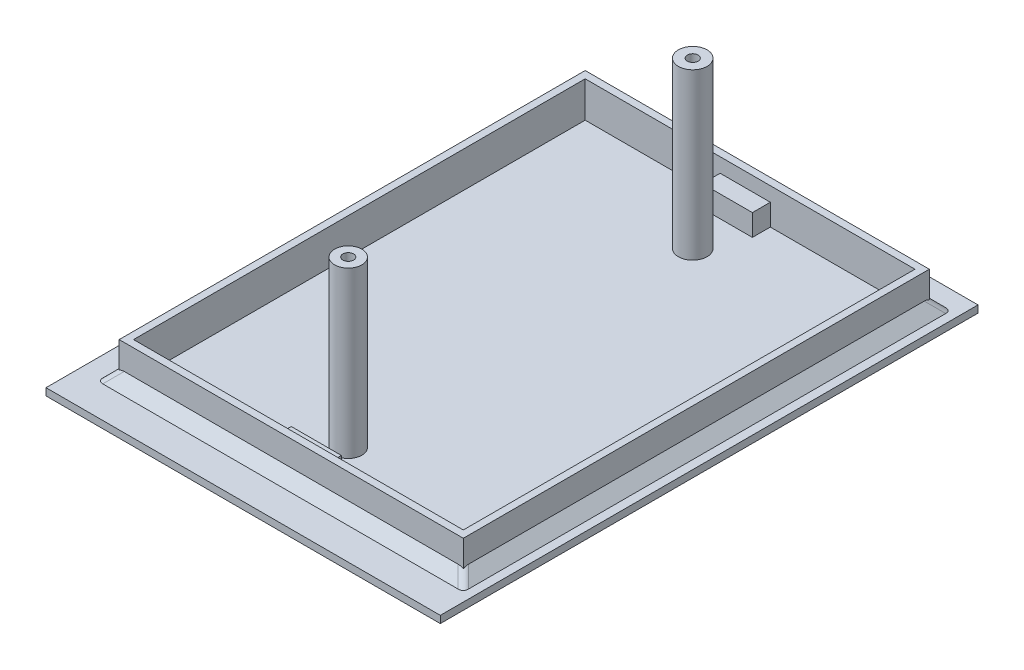
ISO-10303-21;
HEADER;
FILE_DESCRIPTION(('STEP AP214'),'2;1');
FILE_NAME('part.step','',(''),(''),'','','');
FILE_SCHEMA(('AUTOMOTIVE_DESIGN { 1 0 10303 214 1 1 1 1 }'));
ENDSEC;
DATA;
#1=APPLICATION_CONTEXT('core data for automotive mechanical design processes');
#2=APPLICATION_PROTOCOL_DEFINITION('international standard','automotive_design',2000,#1);
#3=PRODUCT_CONTEXT('',#1,'mechanical');
#4=PRODUCT('Part','Part','',(#3));
#5=PRODUCT_RELATED_PRODUCT_CATEGORY('part','',(#4));
#6=PRODUCT_DEFINITION_FORMATION('','',#4);
#7=PRODUCT_DEFINITION_CONTEXT('part definition',#1,'design');
#8=PRODUCT_DEFINITION('design','',#6,#7);
#9=PRODUCT_DEFINITION_SHAPE('','',#8);
#10=(LENGTH_UNIT() NAMED_UNIT(*) SI_UNIT(.MILLI.,.METRE.));
#11=(NAMED_UNIT(*) PLANE_ANGLE_UNIT() SI_UNIT($,.RADIAN.));
#12=(NAMED_UNIT(*) SI_UNIT($,.STERADIAN.) SOLID_ANGLE_UNIT());
#13=UNCERTAINTY_MEASURE_WITH_UNIT(LENGTH_MEASURE(1.E-05),#10,'distance_accuracy_value','');
#14=(GEOMETRIC_REPRESENTATION_CONTEXT(3) GLOBAL_UNCERTAINTY_ASSIGNED_CONTEXT((#13)) GLOBAL_UNIT_ASSIGNED_CONTEXT((#10,
#11,#12)) REPRESENTATION_CONTEXT('',''));
#15=CARTESIAN_POINT('',(0.,0.,0.));
#16=DIRECTION('',(0.,0.,1.));
#17=DIRECTION('',(1.,0.,0.));
#18=AXIS2_PLACEMENT_3D('',#15,#16,#17);
#19=CARTESIAN_POINT('',(0.,0.,0.));
#20=DIRECTION('',(0.,1.,0.));
#21=DIRECTION('',(0.,0.,1.));
#22=AXIS2_PLACEMENT_3D('',#19,#20,#21);
#23=PLANE('',#22);
#24=CARTESIAN_POINT('',(1.42387990874169,0.,-8.40605230060947));
#25=DIRECTION('',(0.,1.,0.));
#26=DIRECTION('',(0.,0.,1.));
#27=AXIS2_PLACEMENT_3D('',#24,#25,#26);
#28=CIRCLE('',#27,2.);
#29=CARTESIAN_POINT('',(1.42387990874169,0.,-6.40605230060947));
#30=VERTEX_POINT('',#29);
#31=EDGE_CURVE('E880',#30,#30,#28,.T.);
#32=ORIENTED_EDGE('',*,*,#31,.F.);
#33=EDGE_LOOP('',(#32));
#34=FACE_BOUND('',#33,.T.);
#35=CARTESIAN_POINT('',(1.42387990874168,0.,39.6439476993905));
#36=DIRECTION('',(0.,1.,0.));
#37=DIRECTION('',(0.,0.,1.));
#38=AXIS2_PLACEMENT_3D('',#35,#36,#37);
#39=CIRCLE('',#38,1.9);
#40=CARTESIAN_POINT('',(1.42387990874168,0.,41.5439476993905));
#41=VERTEX_POINT('',#40);
#42=EDGE_CURVE('E868',#41,#41,#39,.T.);
#43=ORIENTED_EDGE('',*,*,#42,.F.);
#44=EDGE_LOOP('',(#43));
#45=FACE_BOUND('',#44,.T.);
#46=DIRECTION('',(1.,0.,0.));
#47=VECTOR('',#46,1.);
#48=CARTESIAN_POINT('',(-2.75409037972318,0.,-13.9060523006095));
#49=LINE('',#48,#47);
#50=CARTESIAN_POINT('',(-2.75409037972318,0.,-13.9060523006095));
#51=VERTEX_POINT('',#50);
#52=CARTESIAN_POINT('',(4.24590962027682,0.,-13.9060523006095));
#53=VERTEX_POINT('',#52);
#54=EDGE_CURVE('E863',#51,#53,#49,.T.);
#55=ORIENTED_EDGE('',*,*,#54,.F.);
#56=DIRECTION('',(0.,0.,1.));
#57=VECTOR('',#56,1.);
#58=CARTESIAN_POINT('',(-2.75409037972318,0.,-16.4060523006095));
#59=LINE('',#58,#57);
#60=CARTESIAN_POINT('',(-2.75409037972318,0.,-16.4060523006095));
#61=VERTEX_POINT('',#60);
#62=EDGE_CURVE('E245',#61,#51,#59,.T.);
#63=ORIENTED_EDGE('',*,*,#62,.F.);
#64=DIRECTION('',(-1.,0.,0.));
#65=VECTOR('',#64,1.);
#66=CARTESIAN_POINT('',(-21.5761200912583,0.,-16.4060523006095));
#67=LINE('',#66,#65);
#68=CARTESIAN_POINT('',(-21.5761200912583,0.,-16.4060523006095));
#69=VERTEX_POINT('',#68);
#70=EDGE_CURVE('E296',#61,#69,#67,.T.);
#71=ORIENTED_EDGE('',*,*,#70,.T.);
#72=DIRECTION('',(0.,0.,1.));
#73=VECTOR('',#72,1.);
#74=CARTESIAN_POINT('',(-21.5761200912583,0.,-16.4060523006095));
#75=LINE('',#74,#73);
#76=CARTESIAN_POINT('',(-21.5761200912583,0.,46.5939476993905));
#77=VERTEX_POINT('',#76);
#78=EDGE_CURVE('E277',#69,#77,#75,.T.);
#79=ORIENTED_EDGE('',*,*,#78,.T.);
#80=DIRECTION('',(1.,0.,0.));
#81=VECTOR('',#80,1.);
#82=CARTESIAN_POINT('',(-21.5761200912583,0.,46.5939476993905));
#83=LINE('',#82,#81);
#84=CARTESIAN_POINT('',(-2.07612009125831,0.,46.5939476993905));
#85=VERTEX_POINT('',#84);
#86=EDGE_CURVE('E291',#77,#85,#83,.T.);
#87=ORIENTED_EDGE('',*,*,#86,.T.);
#88=DIRECTION('',(0.,0.,1.));
#89=VECTOR('',#88,1.);
#90=CARTESIAN_POINT('',(-2.07612009125831,0.,46.5939476993905));
#91=LINE('',#90,#89);
#92=CARTESIAN_POINT('',(-2.07612009125831,0.,44.0939476993905));
#93=VERTEX_POINT('',#92);
#94=EDGE_CURVE('E259',#93,#85,#91,.T.);
#95=ORIENTED_EDGE('',*,*,#94,.F.);
#96=DIRECTION('',(-1.,0.,0.));
#97=VECTOR('',#96,1.);
#98=CARTESIAN_POINT('',(4.92387990874169,0.,44.0939476993905));
#99=LINE('',#98,#97);
#100=CARTESIAN_POINT('',(4.92387990874169,0.,44.0939476993905));
#101=VERTEX_POINT('',#100);
#102=EDGE_CURVE('E249',#101,#93,#99,.T.);
#103=ORIENTED_EDGE('',*,*,#102,.F.);
#104=DIRECTION('',(0.,0.,-1.));
#105=VECTOR('',#104,1.);
#106=CARTESIAN_POINT('',(4.92387990874169,0.,46.5939476993905));
#107=LINE('',#106,#105);
#108=CARTESIAN_POINT('',(4.92387990874169,0.,46.5939476993905));
#109=VERTEX_POINT('',#108);
#110=EDGE_CURVE('E246',#109,#101,#107,.T.);
#111=ORIENTED_EDGE('',*,*,#110,.F.);
#112=CARTESIAN_POINT('',(24.4238799087417,0.,46.5939476993905));
#113=VERTEX_POINT('',#112);
#114=EDGE_CURVE('E290',#109,#113,#83,.T.);
#115=ORIENTED_EDGE('',*,*,#114,.T.);
#116=DIRECTION('',(0.,0.,-1.));
#117=VECTOR('',#116,1.);
#118=CARTESIAN_POINT('',(24.4238799087417,0.,-16.4060523006095));
#119=LINE('',#118,#117);
#120=CARTESIAN_POINT('',(24.4238799087417,0.,-16.4060523006095));
#121=VERTEX_POINT('',#120);
#122=EDGE_CURVE('E294',#113,#121,#119,.T.);
#123=ORIENTED_EDGE('',*,*,#122,.T.);
#124=CARTESIAN_POINT('',(4.24590962027681,0.,-16.4060523006095));
#125=VERTEX_POINT('',#124);
#126=EDGE_CURVE('E281',#121,#125,#67,.T.);
#127=ORIENTED_EDGE('',*,*,#126,.T.);
#128=DIRECTION('',(0.,0.,-1.));
#129=VECTOR('',#128,1.);
#130=CARTESIAN_POINT('',(4.24590962027682,0.,-16.4060523006095));
#131=LINE('',#130,#129);
#132=EDGE_CURVE('E242',#53,#125,#131,.T.);
#133=ORIENTED_EDGE('',*,*,#132,.F.);
#134=EDGE_LOOP('',(#55,#63,#71,#79,#87,#95,#103,#111,#115,#123,#127,#133));
#135=FACE_BOUND('',#134,.T.);
#136=ADVANCED_FACE('F36',(#34,#45,#135),#23,.T.);
#137=CARTESIAN_POINT('',(-21.5761200912583,5.,-16.4060523006095));
#138=DIRECTION('',(0.,0.,1.));
#139=DIRECTION('',(1.,0.,0.));
#140=AXIS2_PLACEMENT_3D('',#137,#138,#139);
#141=PLANE('',#140);
#142=ORIENTED_EDGE('',*,*,#70,.F.);
#143=DIRECTION('',(0.,-1.,0.));
#144=VECTOR('',#143,1.);
#145=CARTESIAN_POINT('',(-2.75409037972318,3.,-16.4060523006095));
#146=LINE('',#145,#144);
#147=CARTESIAN_POINT('',(-2.75409037972318,3.,-16.4060523006095));
#148=VERTEX_POINT('',#147);
#149=EDGE_CURVE('E858',#148,#61,#146,.T.);
#150=ORIENTED_EDGE('',*,*,#149,.F.);
#151=DIRECTION('',(-1.,0.,0.));
#152=VECTOR('',#151,1.);
#153=CARTESIAN_POINT('',(-2.75409037972318,3.,-16.4060523006095));
#154=LINE('',#153,#152);
#155=CARTESIAN_POINT('',(4.24590962027681,3.,-16.4060523006095));
#156=VERTEX_POINT('',#155);
#157=EDGE_CURVE('E239',#156,#148,#154,.T.);
#158=ORIENTED_EDGE('',*,*,#157,.F.);
#159=DIRECTION('',(0.,-1.,0.));
#160=VECTOR('',#159,1.);
#161=CARTESIAN_POINT('',(4.24590962027682,3.,-16.4060523006095));
#162=LINE('',#161,#160);
#163=EDGE_CURVE('E251',#156,#125,#162,.T.);
#164=ORIENTED_EDGE('',*,*,#163,.T.);
#165=ORIENTED_EDGE('',*,*,#126,.F.);
#166=DIRECTION('',(0.,-1.,0.));
#167=VECTOR('',#166,1.);
#168=CARTESIAN_POINT('',(24.4238799087417,5.,-16.4060523006095));
#169=LINE('',#168,#167);
#170=CARTESIAN_POINT('',(24.4238799087417,5.,-16.4060523006095));
#171=VERTEX_POINT('',#170);
#172=EDGE_CURVE('E301',#171,#121,#169,.T.);
#173=ORIENTED_EDGE('',*,*,#172,.F.);
#174=DIRECTION('',(-1.,0.,0.));
#175=VECTOR('',#174,1.);
#176=CARTESIAN_POINT('',(-21.5761200912583,5.,-16.4060523006095));
#177=LINE('',#176,#175);
#178=CARTESIAN_POINT('',(-21.5761200912583,5.,-16.4060523006095));
#179=VERTEX_POINT('',#178);
#180=EDGE_CURVE('E286',#171,#179,#177,.T.);
#181=ORIENTED_EDGE('',*,*,#180,.T.);
#182=DIRECTION('',(0.,-1.,0.));
#183=VECTOR('',#182,1.);
#184=CARTESIAN_POINT('',(-21.5761200912583,5.,-16.4060523006095));
#185=LINE('',#184,#183);
#186=EDGE_CURVE('E288',#179,#69,#185,.T.);
#187=ORIENTED_EDGE('',*,*,#186,.T.);
#188=EDGE_LOOP('',(#142,#150,#158,#164,#165,#173,#181,#187));
#189=FACE_BOUND('',#188,.T.);
#190=ADVANCED_FACE('F490',(#189),#141,.T.);
#191=CARTESIAN_POINT('',(-21.5761200912583,5.,46.5939476993905));
#192=DIRECTION('',(0.,0.,-1.));
#193=DIRECTION('',(-1.,0.,0.));
#194=AXIS2_PLACEMENT_3D('',#191,#192,#193);
#195=PLANE('',#194);
#196=ORIENTED_EDGE('',*,*,#114,.F.);
#197=DIRECTION('',(0.,-1.,0.));
#198=VECTOR('',#197,1.);
#199=CARTESIAN_POINT('',(4.92387990874169,3.,46.5939476993905));
#200=LINE('',#199,#198);
#201=CARTESIAN_POINT('',(4.92387990874169,3.,46.5939476993905));
#202=VERTEX_POINT('',#201);
#203=EDGE_CURVE('E264',#202,#109,#200,.T.);
#204=ORIENTED_EDGE('',*,*,#203,.F.);
#205=DIRECTION('',(1.,0.,0.));
#206=VECTOR('',#205,1.);
#207=CARTESIAN_POINT('',(4.92387990874169,3.,46.5939476993905));
#208=LINE('',#207,#206);
#209=CARTESIAN_POINT('',(-2.07612009125831,3.,46.5939476993905));
#210=VERTEX_POINT('',#209);
#211=EDGE_CURVE('E263',#210,#202,#208,.T.);
#212=ORIENTED_EDGE('',*,*,#211,.F.);
#213=DIRECTION('',(0.,-1.,0.));
#214=VECTOR('',#213,1.);
#215=CARTESIAN_POINT('',(-2.07612009125831,3.,46.5939476993905));
#216=LINE('',#215,#214);
#217=EDGE_CURVE('E270',#210,#85,#216,.T.);
#218=ORIENTED_EDGE('',*,*,#217,.T.);
#219=ORIENTED_EDGE('',*,*,#86,.F.);
#220=DIRECTION('',(0.,-1.,0.));
#221=VECTOR('',#220,1.);
#222=CARTESIAN_POINT('',(-21.5761200912583,5.,46.5939476993905));
#223=LINE('',#222,#221);
#224=CARTESIAN_POINT('',(-21.5761200912583,5.,46.5939476993905));
#225=VERTEX_POINT('',#224);
#226=EDGE_CURVE('E307',#225,#77,#223,.T.);
#227=ORIENTED_EDGE('',*,*,#226,.F.);
#228=DIRECTION('',(1.,0.,0.));
#229=VECTOR('',#228,1.);
#230=CARTESIAN_POINT('',(-21.5761200912583,5.,46.5939476993905));
#231=LINE('',#230,#229);
#232=CARTESIAN_POINT('',(24.4238799087417,5.,46.5939476993905));
#233=VERTEX_POINT('',#232);
#234=EDGE_CURVE('E280',#225,#233,#231,.T.);
#235=ORIENTED_EDGE('',*,*,#234,.T.);
#236=DIRECTION('',(0.,-1.,0.));
#237=VECTOR('',#236,1.);
#238=CARTESIAN_POINT('',(24.4238799087417,5.,46.5939476993905));
#239=LINE('',#238,#237);
#240=EDGE_CURVE('E304',#233,#113,#239,.T.);
#241=ORIENTED_EDGE('',*,*,#240,.T.);
#242=EDGE_LOOP('',(#196,#204,#212,#218,#219,#227,#235,#241));
#243=FACE_BOUND('',#242,.T.);
#244=ADVANCED_FACE('F498',(#243),#195,.T.);
#245=DIRECTION('',(1.,0.,0.));
#246=VECTOR('',#245,1.);
#247=CARTESIAN_POINT('',(0.,0.,-18.9060523006095));
#248=LINE('',#247,#246);
#249=CARTESIAN_POINT('',(-23.3690133100718,0.,-18.9060523006095));
#250=VERTEX_POINT('',#249);
#251=CARTESIAN_POINT('',(26.2167731275551,0.,-18.9060523006095));
#252=VERTEX_POINT('',#251);
#253=EDGE_CURVE('E363',#250,#252,#248,.T.);
#254=ORIENTED_EDGE('',*,*,#253,.T.);
#255=CARTESIAN_POINT('',(25.5096663463686,0.,-17.4918387382364));
#256=DIRECTION('',(0.,1.,0.));
#257=DIRECTION('',(-0.707106781186548,0.,0.707106781186547));
#258=AXIS2_PLACEMENT_3D('',#255,#256,#257);
#259=ELLIPSE('',#258,1.73205080756888,1.);
#260=CARTESIAN_POINT('',(26.9238799087417,0.,-18.1989455194229));
#261=VERTEX_POINT('',#260);
#262=EDGE_CURVE('E413',#252,#261,#259,.F.);
#263=ORIENTED_EDGE('',*,*,#262,.T.);
#264=DIRECTION('',(0.,0.,1.));
#265=VECTOR('',#264,1.);
#266=CARTESIAN_POINT('',(26.9238799087417,0.,0.));
#267=LINE('',#266,#265);
#268=CARTESIAN_POINT('',(26.9238799087417,0.,48.386840918204));
#269=VERTEX_POINT('',#268);
#270=EDGE_CURVE('E366',#261,#269,#267,.T.);
#271=ORIENTED_EDGE('',*,*,#270,.T.);
#272=CARTESIAN_POINT('',(25.5096663463686,0.,47.6797341370174));
#273=DIRECTION('',(0.,1.,0.));
#274=DIRECTION('',(-0.707106781186548,0.,-0.707106781186547));
#275=AXIS2_PLACEMENT_3D('',#272,#273,#274);
#276=ELLIPSE('',#275,1.73205080756888,1.);
#277=CARTESIAN_POINT('',(26.2167731275551,0.,49.0939476993905));
#278=VERTEX_POINT('',#277);
#279=EDGE_CURVE('E419',#269,#278,#276,.F.);
#280=ORIENTED_EDGE('',*,*,#279,.T.);
#281=DIRECTION('',(-1.,0.,0.));
#282=VECTOR('',#281,1.);
#283=CARTESIAN_POINT('',(0.,0.,49.0939476993905));
#284=LINE('',#283,#282);
#285=CARTESIAN_POINT('',(-23.3690133100718,0.,49.0939476993905));
#286=VERTEX_POINT('',#285);
#287=EDGE_CURVE('E369',#278,#286,#284,.T.);
#288=ORIENTED_EDGE('',*,*,#287,.T.);
#289=CARTESIAN_POINT('',(-22.6619065288852,0.,47.6797341370174));
#290=DIRECTION('',(0.,1.,0.));
#291=DIRECTION('',(-0.707106781186547,0.,0.707106781186548));
#292=AXIS2_PLACEMENT_3D('',#289,#290,#291);
#293=ELLIPSE('',#292,1.73205080756888,1.);
#294=CARTESIAN_POINT('',(-24.0761200912583,0.,48.386840918204));
#295=VERTEX_POINT('',#294);
#296=EDGE_CURVE('E421',#286,#295,#293,.F.);
#297=ORIENTED_EDGE('',*,*,#296,.T.);
#298=DIRECTION('',(0.,0.,-1.));
#299=VECTOR('',#298,1.);
#300=CARTESIAN_POINT('',(-24.0761200912583,0.,0.));
#301=LINE('',#300,#299);
#302=CARTESIAN_POINT('',(-24.0761200912583,0.,-18.1989455194229));
#303=VERTEX_POINT('',#302);
#304=EDGE_CURVE('E360',#295,#303,#301,.T.);
#305=ORIENTED_EDGE('',*,*,#304,.T.);
#306=CARTESIAN_POINT('',(-22.6619065288852,0.,-17.4918387382364));
#307=DIRECTION('',(0.,1.,0.));
#308=DIRECTION('',(-0.707106781186547,0.,-0.707106781186548));
#309=AXIS2_PLACEMENT_3D('',#306,#307,#308);
#310=ELLIPSE('',#309,1.73205080756888,1.);
#311=EDGE_CURVE('E401',#303,#250,#310,.F.);
#312=ORIENTED_EDGE('',*,*,#311,.T.);
#313=EDGE_LOOP('',(#254,#263,#271,#280,#288,#297,#305,#312));
#314=FACE_BOUND('',#313,.T.);
#315=DIRECTION('',(0.,0.,1.));
#316=VECTOR('',#315,1.);
#317=CARTESIAN_POINT('',(-26.8692810457516,0.,-21.4901960784314));
#318=LINE('',#317,#316);
#319=CARTESIAN_POINT('',(-26.8692810457516,0.,-21.4901960784314));
#320=VERTEX_POINT('',#319);
#321=CARTESIAN_POINT('',(-26.8692810457516,0.,53.5098039215686));
#322=VERTEX_POINT('',#321);
#323=EDGE_CURVE('E325',#320,#322,#318,.T.);
#324=ORIENTED_EDGE('',*,*,#323,.T.);
#325=DIRECTION('',(1.,0.,0.));
#326=VECTOR('',#325,1.);
#327=CARTESIAN_POINT('',(-26.8692810457516,0.,53.5098039215686));
#328=LINE('',#327,#326);
#329=CARTESIAN_POINT('',(28.1307189542484,0.,53.5098039215686));
#330=VERTEX_POINT('',#329);
#331=EDGE_CURVE('E342',#322,#330,#328,.T.);
#332=ORIENTED_EDGE('',*,*,#331,.T.);
#333=DIRECTION('',(0.,0.,-1.));
#334=VECTOR('',#333,1.);
#335=CARTESIAN_POINT('',(28.1307189542484,0.,-21.4901960784314));
#336=LINE('',#335,#334);
#337=CARTESIAN_POINT('',(28.1307189542484,0.,-21.4901960784314));
#338=VERTEX_POINT('',#337);
#339=EDGE_CURVE('E345',#330,#338,#336,.T.);
#340=ORIENTED_EDGE('',*,*,#339,.T.);
#341=DIRECTION('',(-1.,0.,0.));
#342=VECTOR('',#341,1.);
#343=CARTESIAN_POINT('',(-26.8692810457516,0.,-21.4901960784314));
#344=LINE('',#343,#342);
#345=EDGE_CURVE('E330',#338,#320,#344,.T.);
#346=ORIENTED_EDGE('',*,*,#345,.T.);
#347=EDGE_LOOP('',(#324,#332,#340,#346));
#348=FACE_BOUND('',#347,.T.);
#349=ADVANCED_FACE('F462',(#314,#348),#23,.T.);
#350=CARTESIAN_POINT('',(-26.8692810457516,-1.,-21.4901960784314));
#351=DIRECTION('',(-1.,0.,0.));
#352=DIRECTION('',(0.,0.,1.));
#353=AXIS2_PLACEMENT_3D('',#350,#351,#352);
#354=PLANE('',#353);
#355=ORIENTED_EDGE('',*,*,#323,.F.);
#356=DIRECTION('',(0.,1.,0.));
#357=VECTOR('',#356,1.);
#358=CARTESIAN_POINT('',(-26.8692810457516,-1.,-21.4901960784314));
#359=LINE('',#358,#357);
#360=CARTESIAN_POINT('',(-26.8692810457516,-1.,-21.4901960784314));
#361=VERTEX_POINT('',#360);
#362=EDGE_CURVE('E350',#361,#320,#359,.T.);
#363=ORIENTED_EDGE('',*,*,#362,.F.);
#364=DIRECTION('',(0.,0.,1.));
#365=VECTOR('',#364,1.);
#366=CARTESIAN_POINT('',(-26.8692810457516,-1.,-21.4901960784314));
#367=LINE('',#366,#365);
#368=CARTESIAN_POINT('',(-26.8692810457516,-1.,53.5098039215686));
#369=VERTEX_POINT('',#368);
#370=EDGE_CURVE('E326',#361,#369,#367,.T.);
#371=ORIENTED_EDGE('',*,*,#370,.T.);
#372=DIRECTION('',(0.,1.,0.));
#373=VECTOR('',#372,1.);
#374=CARTESIAN_POINT('',(-26.8692810457516,-1.,53.5098039215686));
#375=LINE('',#374,#373);
#376=EDGE_CURVE('E339',#369,#322,#375,.T.);
#377=ORIENTED_EDGE('',*,*,#376,.T.);
#378=EDGE_LOOP('',(#355,#363,#371,#377));
#379=FACE_BOUND('',#378,.T.);
#380=ADVANCED_FACE('F506',(#379),#354,.T.);
#381=CARTESIAN_POINT('',(-26.8692810457516,-1.,-21.4901960784314));
#382=DIRECTION('',(0.,0.,-1.));
#383=DIRECTION('',(-1.,0.,0.));
#384=AXIS2_PLACEMENT_3D('',#381,#382,#383);
#385=PLANE('',#384);
#386=ORIENTED_EDGE('',*,*,#345,.F.);
#387=DIRECTION('',(0.,1.,0.));
#388=VECTOR('',#387,1.);
#389=CARTESIAN_POINT('',(28.1307189542484,-1.,-21.4901960784314));
#390=LINE('',#389,#388);
#391=CARTESIAN_POINT('',(28.1307189542484,-1.,-21.4901960784314));
#392=VERTEX_POINT('',#391);
#393=EDGE_CURVE('E353',#392,#338,#390,.T.);
#394=ORIENTED_EDGE('',*,*,#393,.F.);
#395=DIRECTION('',(-1.,0.,0.));
#396=VECTOR('',#395,1.);
#397=CARTESIAN_POINT('',(-26.8692810457516,-1.,-21.4901960784314));
#398=LINE('',#397,#396);
#399=EDGE_CURVE('E336',#392,#361,#398,.T.);
#400=ORIENTED_EDGE('',*,*,#399,.T.);
#401=ORIENTED_EDGE('',*,*,#362,.T.);
#402=EDGE_LOOP('',(#386,#394,#400,#401));
#403=FACE_BOUND('',#402,.T.);
#404=ADVANCED_FACE('F512',(#403),#385,.T.);
#405=CARTESIAN_POINT('',(28.1307189542484,-1.,-21.4901960784314));
#406=DIRECTION('',(1.,0.,0.));
#407=DIRECTION('',(0.,0.,-1.));
#408=AXIS2_PLACEMENT_3D('',#405,#406,#407);
#409=PLANE('',#408);
#410=ORIENTED_EDGE('',*,*,#339,.F.);
#411=DIRECTION('',(0.,1.,0.));
#412=VECTOR('',#411,1.);
#413=CARTESIAN_POINT('',(28.1307189542484,-1.,53.5098039215686));
#414=LINE('',#413,#412);
#415=CARTESIAN_POINT('',(28.1307189542484,-1.,53.5098039215686));
#416=VERTEX_POINT('',#415);
#417=EDGE_CURVE('E355',#416,#330,#414,.T.);
#418=ORIENTED_EDGE('',*,*,#417,.F.);
#419=DIRECTION('',(0.,0.,-1.));
#420=VECTOR('',#419,1.);
#421=CARTESIAN_POINT('',(28.1307189542484,-1.,-21.4901960784314));
#422=LINE('',#421,#420);
#423=EDGE_CURVE('E333',#416,#392,#422,.T.);
#424=ORIENTED_EDGE('',*,*,#423,.T.);
#425=ORIENTED_EDGE('',*,*,#393,.T.);
#426=EDGE_LOOP('',(#410,#418,#424,#425));
#427=FACE_BOUND('',#426,.T.);
#428=ADVANCED_FACE('F544',(#427),#409,.T.);
#429=CARTESIAN_POINT('',(-26.8692810457516,-1.,53.5098039215686));
#430=DIRECTION('',(0.,0.,1.));
#431=DIRECTION('',(1.,0.,0.));
#432=AXIS2_PLACEMENT_3D('',#429,#430,#431);
#433=PLANE('',#432);
#434=ORIENTED_EDGE('',*,*,#331,.F.);
#435=ORIENTED_EDGE('',*,*,#376,.F.);
#436=DIRECTION('',(1.,0.,0.));
#437=VECTOR('',#436,1.);
#438=CARTESIAN_POINT('',(-26.8692810457516,-1.,53.5098039215686));
#439=LINE('',#438,#437);
#440=EDGE_CURVE('E329',#369,#416,#439,.T.);
#441=ORIENTED_EDGE('',*,*,#440,.T.);
#442=ORIENTED_EDGE('',*,*,#417,.T.);
#443=EDGE_LOOP('',(#434,#435,#441,#442));
#444=FACE_BOUND('',#443,.T.);
#445=ADVANCED_FACE('F539',(#444),#433,.T.);
#446=CARTESIAN_POINT('',(0.,-1.,0.));
#447=DIRECTION('',(0.,1.,0.));
#448=DIRECTION('',(0.,0.,1.));
#449=AXIS2_PLACEMENT_3D('',#446,#447,#448);
#450=PLANE('',#449);
#451=ORIENTED_EDGE('',*,*,#370,.F.);
#452=ORIENTED_EDGE('',*,*,#399,.F.);
#453=ORIENTED_EDGE('',*,*,#423,.F.);
#454=ORIENTED_EDGE('',*,*,#440,.F.);
#455=EDGE_LOOP('',(#451,#452,#453,#454));
#456=FACE_BOUND('',#455,.T.);
#457=ADVANCED_FACE('F531',(#456),#450,.F.);
#458=CARTESIAN_POINT('',(0.,5.,0.));
#459=DIRECTION('',(0.,1.,0.));
#460=DIRECTION('',(0.,0.,1.));
#461=AXIS2_PLACEMENT_3D('',#458,#459,#460);
#462=PLANE('',#461);
#463=DIRECTION('',(0.,0.,1.));
#464=VECTOR('',#463,1.);
#465=CARTESIAN_POINT('',(-22.5761200912583,5.,-17.4060523006095));
#466=LINE('',#465,#464);
#467=CARTESIAN_POINT('',(-22.5761200912583,5.,-17.4060523006095));
#468=VERTEX_POINT('',#467);
#469=CARTESIAN_POINT('',(-22.5761200912583,5.,47.5939476993905));
#470=VERTEX_POINT('',#469);
#471=EDGE_CURVE('E310',#468,#470,#466,.T.);
#472=ORIENTED_EDGE('',*,*,#471,.T.);
#473=DIRECTION('',(1.,0.,0.));
#474=VECTOR('',#473,1.);
#475=CARTESIAN_POINT('',(-22.5761200912583,5.,47.5939476993905));
#476=LINE('',#475,#474);
#477=CARTESIAN_POINT('',(25.4238799087417,5.,47.5939476993905));
#478=VERTEX_POINT('',#477);
#479=EDGE_CURVE('E313',#470,#478,#476,.T.);
#480=ORIENTED_EDGE('',*,*,#479,.T.);
#481=DIRECTION('',(0.,0.,-1.));
#482=VECTOR('',#481,1.);
#483=CARTESIAN_POINT('',(25.4238799087417,5.,-17.4060523006095));
#484=LINE('',#483,#482);
#485=CARTESIAN_POINT('',(25.4238799087417,5.,-17.4060523006095));
#486=VERTEX_POINT('',#485);
#487=EDGE_CURVE('E315',#478,#486,#484,.T.);
#488=ORIENTED_EDGE('',*,*,#487,.T.);
#489=DIRECTION('',(-1.,0.,0.));
#490=VECTOR('',#489,1.);
#491=CARTESIAN_POINT('',(-22.5761200912583,5.,-17.4060523006095));
#492=LINE('',#491,#490);
#493=EDGE_CURVE('E317',#486,#468,#492,.T.);
#494=ORIENTED_EDGE('',*,*,#493,.T.);
#495=EDGE_LOOP('',(#472,#480,#488,#494));
#496=FACE_BOUND('',#495,.T.);
#497=ORIENTED_EDGE('',*,*,#234,.F.);
#498=DIRECTION('',(0.,0.,1.));
#499=VECTOR('',#498,1.);
#500=CARTESIAN_POINT('',(-21.5761200912583,5.,-16.4060523006095));
#501=LINE('',#500,#499);
#502=EDGE_CURVE('E278',#179,#225,#501,.T.);
#503=ORIENTED_EDGE('',*,*,#502,.F.);
#504=ORIENTED_EDGE('',*,*,#180,.F.);
#505=DIRECTION('',(0.,0.,-1.));
#506=VECTOR('',#505,1.);
#507=CARTESIAN_POINT('',(24.4238799087417,5.,-16.4060523006095));
#508=LINE('',#507,#506);
#509=EDGE_CURVE('E283',#233,#171,#508,.T.);
#510=ORIENTED_EDGE('',*,*,#509,.F.);
#511=EDGE_LOOP('',(#497,#503,#504,#510));
#512=FACE_BOUND('',#511,.T.);
#513=ADVANCED_FACE('F446',(#496,#512),#462,.T.);
#514=CARTESIAN_POINT('',(-22.5761200912583,5.,-17.4060523006095));
#515=DIRECTION('',(1.,0.,0.));
#516=DIRECTION('',(0.,0.,-1.));
#517=AXIS2_PLACEMENT_3D('',#514,#515,#516);
#518=PLANE('',#517);
#519=DIRECTION('',(0.,-1.,0.));
#520=VECTOR('',#519,1.);
#521=CARTESIAN_POINT('',(-22.5761200912583,5.,-17.4060523006095));
#522=LINE('',#521,#520);
#523=CARTESIAN_POINT('',(-22.5761200912583,1.31053130901849,-17.4060523006095));
#524=VERTEX_POINT('',#523);
#525=EDGE_CURVE('E319',#468,#524,#522,.T.);
#526=ORIENTED_EDGE('',*,*,#525,.T.);
#527=CARTESIAN_POINT('',(-22.5761200912583,0.0857864376269039,-17.4060523006095));
#528=DIRECTION('',(1.,0.,0.));
#529=DIRECTION('',(0.,-0.707106781186548,-0.707106781186548));
#530=AXIS2_PLACEMENT_3D('',#527,#528,#529);
#531=ELLIPSE('',#530,1.73205080756888,1.);
#532=CARTESIAN_POINT('',(-22.5761200912583,1.5,-16.6989455194229));
#533=VERTEX_POINT('',#532);
#534=EDGE_CURVE('E406',#524,#533,#531,.T.);
#535=ORIENTED_EDGE('',*,*,#534,.T.);
#536=DIRECTION('',(0.,0.,1.));
#537=VECTOR('',#536,1.);
#538=CARTESIAN_POINT('',(-22.5761200912583,1.5,-17.4060523006095));
#539=LINE('',#538,#537);
#540=CARTESIAN_POINT('',(-22.5761200912583,1.5,46.886840918204));
#541=VERTEX_POINT('',#540);
#542=EDGE_CURVE('E378',#533,#541,#539,.T.);
#543=ORIENTED_EDGE('',*,*,#542,.T.);
#544=CARTESIAN_POINT('',(-22.5761200912583,0.085786437626904,47.5939476993905));
#545=DIRECTION('',(1.,0.,0.));
#546=DIRECTION('',(0.,-0.707106781186548,0.707106781186548));
#547=AXIS2_PLACEMENT_3D('',#544,#545,#546);
#548=ELLIPSE('',#547,1.73205080756888,1.);
#549=CARTESIAN_POINT('',(-22.5761200912583,1.31053130901849,47.5939476993905));
#550=VERTEX_POINT('',#549);
#551=EDGE_CURVE('E44',#541,#550,#548,.T.);
#552=ORIENTED_EDGE('',*,*,#551,.T.);
#553=DIRECTION('',(0.,-1.,0.));
#554=VECTOR('',#553,1.);
#555=CARTESIAN_POINT('',(-22.5761200912583,5.,47.5939476993905));
#556=LINE('',#555,#554);
#557=EDGE_CURVE('E50',#470,#550,#556,.T.);
#558=ORIENTED_EDGE('',*,*,#557,.F.);
#559=ORIENTED_EDGE('',*,*,#471,.F.);
#560=EDGE_LOOP('',(#526,#535,#543,#552,#558,#559));
#561=FACE_BOUND('',#560,.T.);
#562=ADVANCED_FACE('F425',(#561),#518,.F.);
#563=CARTESIAN_POINT('',(-22.5761200912583,5.,47.5939476993905));
#564=DIRECTION('',(0.,0.,-1.));
#565=DIRECTION('',(-1.,0.,0.));
#566=AXIS2_PLACEMENT_3D('',#563,#564,#565);
#567=PLANE('',#566);
#568=ORIENTED_EDGE('',*,*,#557,.T.);
#569=CARTESIAN_POINT('',(-22.5761200912583,0.0857864376269077,47.5939476993905));
#570=DIRECTION('',(0.,0.,-1.));
#571=DIRECTION('',(-0.707106781186547,-0.707106781186548,0.));
#572=AXIS2_PLACEMENT_3D('',#569,#570,#571);
#573=ELLIPSE('',#572,1.73205080756888,1.);
#574=CARTESIAN_POINT('',(-21.8690133100718,1.5,47.5939476993905));
#575=VERTEX_POINT('',#574);
#576=EDGE_CURVE('E11',#550,#575,#573,.T.);
#577=ORIENTED_EDGE('',*,*,#576,.T.);
#578=DIRECTION('',(1.,0.,0.));
#579=VECTOR('',#578,1.);
#580=CARTESIAN_POINT('',(-22.5761200912583,1.5,47.5939476993905));
#581=LINE('',#580,#579);
#582=CARTESIAN_POINT('',(24.7167731275551,1.5,47.5939476993905));
#583=VERTEX_POINT('',#582);
#584=EDGE_CURVE('E352',#575,#583,#581,.T.);
#585=ORIENTED_EDGE('',*,*,#584,.T.);
#586=CARTESIAN_POINT('',(25.4238799087417,0.0857864376269113,47.5939476993905));
#587=DIRECTION('',(0.,0.,-1.));
#588=DIRECTION('',(-0.707106781186548,0.707106781186547,0.));
#589=AXIS2_PLACEMENT_3D('',#586,#587,#588);
#590=ELLIPSE('',#589,1.73205080756888,1.);
#591=CARTESIAN_POINT('',(25.4238799087417,1.31053130901849,47.5939476993905));
#592=VERTEX_POINT('',#591);
#593=EDGE_CURVE('E415',#583,#592,#590,.T.);
#594=ORIENTED_EDGE('',*,*,#593,.T.);
#595=DIRECTION('',(0.,-1.,0.));
#596=VECTOR('',#595,1.);
#597=CARTESIAN_POINT('',(25.4238799087417,5.,47.5939476993905));
#598=LINE('',#597,#596);
#599=EDGE_CURVE('E58',#478,#592,#598,.T.);
#600=ORIENTED_EDGE('',*,*,#599,.F.);
#601=ORIENTED_EDGE('',*,*,#479,.F.);
#602=EDGE_LOOP('',(#568,#577,#585,#594,#600,#601));
#603=FACE_BOUND('',#602,.T.);
#604=ADVANCED_FACE('F432',(#603),#567,.F.);
#605=CARTESIAN_POINT('',(25.4238799087417,5.,-17.4060523006095));
#606=DIRECTION('',(-1.,0.,0.));
#607=DIRECTION('',(0.,0.,1.));
#608=AXIS2_PLACEMENT_3D('',#605,#606,#607);
#609=PLANE('',#608);
#610=ORIENTED_EDGE('',*,*,#599,.T.);
#611=CARTESIAN_POINT('',(25.4238799087417,0.0857864376268905,47.5939476993906));
#612=DIRECTION('',(-1.,0.,0.));
#613=DIRECTION('',(0.,0.707106781186547,-0.707106781186548));
#614=AXIS2_PLACEMENT_3D('',#611,#612,#613);
#615=ELLIPSE('',#614,1.73205080756888,1.);
#616=CARTESIAN_POINT('',(25.4238799087417,1.5,46.886840918204));
#617=VERTEX_POINT('',#616);
#618=EDGE_CURVE('E417',#592,#617,#615,.T.);
#619=ORIENTED_EDGE('',*,*,#618,.T.);
#620=DIRECTION('',(0.,0.,-1.));
#621=VECTOR('',#620,1.);
#622=CARTESIAN_POINT('',(25.4238799087417,1.5,-17.4060523006095));
#623=LINE('',#622,#621);
#624=CARTESIAN_POINT('',(25.4238799087417,1.5,-16.6989455194229));
#625=VERTEX_POINT('',#624);
#626=EDGE_CURVE('E372',#617,#625,#623,.T.);
#627=ORIENTED_EDGE('',*,*,#626,.T.);
#628=CARTESIAN_POINT('',(25.4238799087417,0.0857864376269047,-17.4060523006095));
#629=DIRECTION('',(-1.,0.,0.));
#630=DIRECTION('',(0.,0.707106781186548,0.707106781186548));
#631=AXIS2_PLACEMENT_3D('',#628,#629,#630);
#632=ELLIPSE('',#631,1.73205080756888,1.);
#633=CARTESIAN_POINT('',(25.4238799087417,1.31053130901849,-17.4060523006095));
#634=VERTEX_POINT('',#633);
#635=EDGE_CURVE('E408',#625,#634,#632,.T.);
#636=ORIENTED_EDGE('',*,*,#635,.T.);
#637=DIRECTION('',(0.,-1.,0.));
#638=VECTOR('',#637,1.);
#639=CARTESIAN_POINT('',(25.4238799087417,5.,-17.4060523006095));
#640=LINE('',#639,#638);
#641=EDGE_CURVE('E321',#486,#634,#640,.T.);
#642=ORIENTED_EDGE('',*,*,#641,.F.);
#643=ORIENTED_EDGE('',*,*,#487,.F.);
#644=EDGE_LOOP('',(#610,#619,#627,#636,#642,#643));
#645=FACE_BOUND('',#644,.T.);
#646=ADVANCED_FACE('F443',(#645),#609,.F.);
#647=CARTESIAN_POINT('',(-22.5761200912583,5.,-17.4060523006095));
#648=DIRECTION('',(0.,0.,1.));
#649=DIRECTION('',(1.,0.,0.));
#650=AXIS2_PLACEMENT_3D('',#647,#648,#649);
#651=PLANE('',#650);
#652=ORIENTED_EDGE('',*,*,#641,.T.);
#653=CARTESIAN_POINT('',(25.4238799087417,0.0857864376269039,-17.4060523006095));
#654=DIRECTION('',(0.,0.,1.));
#655=DIRECTION('',(-0.707106781186548,0.707106781186547,0.));
#656=AXIS2_PLACEMENT_3D('',#653,#654,#655);
#657=ELLIPSE('',#656,1.73205080756888,1.);
#658=CARTESIAN_POINT('',(24.7167731275551,1.5,-17.4060523006095));
#659=VERTEX_POINT('',#658);
#660=EDGE_CURVE('E411',#634,#659,#657,.T.);
#661=ORIENTED_EDGE('',*,*,#660,.T.);
#662=DIRECTION('',(-1.,0.,0.));
#663=VECTOR('',#662,1.);
#664=CARTESIAN_POINT('',(-22.5761200912583,1.5,-17.4060523006095));
#665=LINE('',#664,#663);
#666=CARTESIAN_POINT('',(-21.8690133100718,1.5,-17.4060523006095));
#667=VERTEX_POINT('',#666);
#668=EDGE_CURVE('E375',#659,#667,#665,.T.);
#669=ORIENTED_EDGE('',*,*,#668,.T.);
#670=CARTESIAN_POINT('',(-22.5761200912583,0.0857864376269041,-17.4060523006095));
#671=DIRECTION('',(0.,0.,1.));
#672=DIRECTION('',(-0.707106781186547,-0.707106781186548,0.));
#673=AXIS2_PLACEMENT_3D('',#670,#671,#672);
#674=ELLIPSE('',#673,1.73205080756888,1.);
#675=EDGE_CURVE('E403',#667,#524,#674,.T.);
#676=ORIENTED_EDGE('',*,*,#675,.T.);
#677=ORIENTED_EDGE('',*,*,#525,.F.);
#678=ORIENTED_EDGE('',*,*,#493,.F.);
#679=EDGE_LOOP('',(#652,#661,#669,#676,#677,#678));
#680=FACE_BOUND('',#679,.T.);
#681=ADVANCED_FACE('F452',(#680),#651,.F.);
#682=CARTESIAN_POINT('',(-21.5761200912583,5.,-16.4060523006095));
#683=DIRECTION('',(1.,0.,0.));
#684=DIRECTION('',(0.,0.,-1.));
#685=AXIS2_PLACEMENT_3D('',#682,#683,#684);
#686=PLANE('',#685);
#687=ORIENTED_EDGE('',*,*,#78,.F.);
#688=ORIENTED_EDGE('',*,*,#186,.F.);
#689=ORIENTED_EDGE('',*,*,#502,.T.);
#690=ORIENTED_EDGE('',*,*,#226,.T.);
#691=EDGE_LOOP('',(#687,#688,#689,#690));
#692=FACE_BOUND('',#691,.T.);
#693=ADVANCED_FACE('F525',(#692),#686,.T.);
#694=CARTESIAN_POINT('',(24.4238799087417,5.,-16.4060523006095));
#695=DIRECTION('',(-1.,0.,0.));
#696=DIRECTION('',(0.,0.,1.));
#697=AXIS2_PLACEMENT_3D('',#694,#695,#696);
#698=PLANE('',#697);
#699=ORIENTED_EDGE('',*,*,#122,.F.);
#700=ORIENTED_EDGE('',*,*,#240,.F.);
#701=ORIENTED_EDGE('',*,*,#509,.T.);
#702=ORIENTED_EDGE('',*,*,#172,.T.);
#703=EDGE_LOOP('',(#699,#700,#701,#702));
#704=FACE_BOUND('',#703,.T.);
#705=ADVANCED_FACE('F524',(#704),#698,.T.);
#706=CARTESIAN_POINT('',(4.92387990874169,3.,46.5939476993905));
#707=DIRECTION('',(-1.,0.,0.));
#708=DIRECTION('',(0.,0.,1.));
#709=AXIS2_PLACEMENT_3D('',#706,#707,#708);
#710=PLANE('',#709);
#711=ORIENTED_EDGE('',*,*,#110,.T.);
#712=DIRECTION('',(0.,-1.,0.));
#713=VECTOR('',#712,1.);
#714=CARTESIAN_POINT('',(4.92387990874169,3.,44.0939476993905));
#715=LINE('',#714,#713);
#716=CARTESIAN_POINT('',(4.92387990874169,3.,44.0939476993905));
#717=VERTEX_POINT('',#716);
#718=EDGE_CURVE('E275',#717,#101,#715,.T.);
#719=ORIENTED_EDGE('',*,*,#718,.F.);
#720=DIRECTION('',(0.,0.,-1.));
#721=VECTOR('',#720,1.);
#722=CARTESIAN_POINT('',(4.92387990874169,3.,46.5939476993905));
#723=LINE('',#722,#721);
#724=EDGE_CURVE('E255',#202,#717,#723,.T.);
#725=ORIENTED_EDGE('',*,*,#724,.F.);
#726=ORIENTED_EDGE('',*,*,#203,.T.);
#727=EDGE_LOOP('',(#711,#719,#725,#726));
#728=FACE_BOUND('',#727,.T.);
#729=ADVANCED_FACE('F736',(#728),#710,.F.);
#730=CARTESIAN_POINT('',(4.92387990874169,3.,44.0939476993905));
#731=DIRECTION('',(0.,0.,1.));
#732=DIRECTION('',(1.,0.,0.));
#733=AXIS2_PLACEMENT_3D('',#730,#731,#732);
#734=PLANE('',#733);
#735=ORIENTED_EDGE('',*,*,#102,.T.);
#736=DIRECTION('',(0.,-1.,0.));
#737=VECTOR('',#736,1.);
#738=CARTESIAN_POINT('',(-2.07612009125831,3.,44.0939476993905));
#739=LINE('',#738,#737);
#740=CARTESIAN_POINT('',(-2.07612009125831,3.,44.0939476993905));
#741=VERTEX_POINT('',#740);
#742=EDGE_CURVE('E273',#741,#93,#739,.T.);
#743=ORIENTED_EDGE('',*,*,#742,.F.);
#744=DIRECTION('',(-1.,0.,0.));
#745=VECTOR('',#744,1.);
#746=CARTESIAN_POINT('',(4.92387990874169,3.,44.0939476993905));
#747=LINE('',#746,#745);
#748=EDGE_CURVE('E258',#717,#741,#747,.T.);
#749=ORIENTED_EDGE('',*,*,#748,.F.);
#750=ORIENTED_EDGE('',*,*,#718,.T.);
#751=EDGE_LOOP('',(#735,#743,#749,#750));
#752=FACE_BOUND('',#751,.T.);
#753=ADVANCED_FACE('F727',(#752),#734,.F.);
#754=CARTESIAN_POINT('',(-2.07612009125831,3.,46.5939476993905));
#755=DIRECTION('',(1.,0.,0.));
#756=DIRECTION('',(0.,0.,-1.));
#757=AXIS2_PLACEMENT_3D('',#754,#755,#756);
#758=PLANE('',#757);
#759=ORIENTED_EDGE('',*,*,#94,.T.);
#760=ORIENTED_EDGE('',*,*,#217,.F.);
#761=DIRECTION('',(0.,0.,1.));
#762=VECTOR('',#761,1.);
#763=CARTESIAN_POINT('',(-2.07612009125831,3.,46.5939476993905));
#764=LINE('',#763,#762);
#765=EDGE_CURVE('E261',#741,#210,#764,.T.);
#766=ORIENTED_EDGE('',*,*,#765,.F.);
#767=ORIENTED_EDGE('',*,*,#742,.T.);
#768=EDGE_LOOP('',(#759,#760,#766,#767));
#769=FACE_BOUND('',#768,.T.);
#770=ADVANCED_FACE('F718',(#769),#758,.F.);
#771=CARTESIAN_POINT('',(0.,3.,0.));
#772=DIRECTION('',(0.,1.,0.));
#773=DIRECTION('',(0.,0.,1.));
#774=AXIS2_PLACEMENT_3D('',#771,#772,#773);
#775=PLANE('',#774);
#776=ORIENTED_EDGE('',*,*,#724,.T.);
#777=ORIENTED_EDGE('',*,*,#748,.T.);
#778=ORIENTED_EDGE('',*,*,#765,.T.);
#779=ORIENTED_EDGE('',*,*,#211,.T.);
#780=EDGE_LOOP('',(#776,#777,#778,#779));
#781=FACE_BOUND('',#780,.T.);
#782=ADVANCED_FACE('F710',(#781),#775,.T.);
#783=CARTESIAN_POINT('',(-2.75409037972318,3.,-16.4060523006095));
#784=DIRECTION('',(1.,0.,0.));
#785=DIRECTION('',(0.,0.,-1.));
#786=AXIS2_PLACEMENT_3D('',#783,#784,#785);
#787=PLANE('',#786);
#788=ORIENTED_EDGE('',*,*,#62,.T.);
#789=DIRECTION('',(0.,-1.,0.));
#790=VECTOR('',#789,1.);
#791=CARTESIAN_POINT('',(-2.75409037972318,3.,-13.9060523006095));
#792=LINE('',#791,#790);
#793=CARTESIAN_POINT('',(-2.75409037972318,3.,-13.9060523006095));
#794=VERTEX_POINT('',#793);
#795=EDGE_CURVE('E226',#794,#51,#792,.T.);
#796=ORIENTED_EDGE('',*,*,#795,.F.);
#797=DIRECTION('',(0.,0.,1.));
#798=VECTOR('',#797,1.);
#799=CARTESIAN_POINT('',(-2.75409037972318,3.,-16.4060523006095));
#800=LINE('',#799,#798);
#801=EDGE_CURVE('E234',#148,#794,#800,.T.);
#802=ORIENTED_EDGE('',*,*,#801,.F.);
#803=ORIENTED_EDGE('',*,*,#149,.T.);
#804=EDGE_LOOP('',(#788,#796,#802,#803));
#805=FACE_BOUND('',#804,.T.);
#806=ADVANCED_FACE('F244',(#805),#787,.F.);
#807=CARTESIAN_POINT('',(-2.75409037972318,3.,-13.9060523006095));
#808=DIRECTION('',(0.,0.,-1.));
#809=DIRECTION('',(-1.,0.,0.));
#810=AXIS2_PLACEMENT_3D('',#807,#808,#809);
#811=PLANE('',#810);
#812=ORIENTED_EDGE('',*,*,#54,.T.);
#813=DIRECTION('',(0.,-1.,0.));
#814=VECTOR('',#813,1.);
#815=CARTESIAN_POINT('',(4.24590962027682,3.,-13.9060523006095));
#816=LINE('',#815,#814);
#817=CARTESIAN_POINT('',(4.24590962027682,3.,-13.9060523006095));
#818=VERTEX_POINT('',#817);
#819=EDGE_CURVE('E229',#818,#53,#816,.T.);
#820=ORIENTED_EDGE('',*,*,#819,.F.);
#821=DIRECTION('',(1.,0.,0.));
#822=VECTOR('',#821,1.);
#823=CARTESIAN_POINT('',(-2.75409037972318,3.,-13.9060523006095));
#824=LINE('',#823,#822);
#825=EDGE_CURVE('E221',#794,#818,#824,.T.);
#826=ORIENTED_EDGE('',*,*,#825,.F.);
#827=ORIENTED_EDGE('',*,*,#795,.T.);
#828=EDGE_LOOP('',(#812,#820,#826,#827));
#829=FACE_BOUND('',#828,.T.);
#830=ADVANCED_FACE('F224',(#829),#811,.F.);
#831=CARTESIAN_POINT('',(4.24590962027682,3.,-16.4060523006095));
#832=DIRECTION('',(-1.,0.,0.));
#833=DIRECTION('',(0.,0.,1.));
#834=AXIS2_PLACEMENT_3D('',#831,#832,#833);
#835=PLANE('',#834);
#836=ORIENTED_EDGE('',*,*,#132,.T.);
#837=ORIENTED_EDGE('',*,*,#163,.F.);
#838=DIRECTION('',(0.,0.,-1.));
#839=VECTOR('',#838,1.);
#840=CARTESIAN_POINT('',(4.24590962027682,3.,-16.4060523006095));
#841=LINE('',#840,#839);
#842=EDGE_CURVE('E233',#818,#156,#841,.T.);
#843=ORIENTED_EDGE('',*,*,#842,.F.);
#844=ORIENTED_EDGE('',*,*,#819,.T.);
#845=EDGE_LOOP('',(#836,#837,#843,#844));
#846=FACE_BOUND('',#845,.T.);
#847=ADVANCED_FACE('F687',(#846),#835,.F.);
#848=CARTESIAN_POINT('',(0.,3.,0.));
#849=DIRECTION('',(0.,1.,0.));
#850=DIRECTION('',(0.,0.,1.));
#851=AXIS2_PLACEMENT_3D('',#848,#849,#850);
#852=PLANE('',#851);
#853=ORIENTED_EDGE('',*,*,#801,.T.);
#854=ORIENTED_EDGE('',*,*,#825,.T.);
#855=ORIENTED_EDGE('',*,*,#842,.T.);
#856=ORIENTED_EDGE('',*,*,#157,.T.);
#857=EDGE_LOOP('',(#853,#854,#855,#856));
#858=FACE_BOUND('',#857,.T.);
#859=ADVANCED_FACE('F238',(#858),#852,.T.);
#860=CARTESIAN_POINT('',(1.42387990874168,23.,39.6439476993905));
#861=DIRECTION('',(0.,-1.,0.));
#862=DIRECTION('',(0.,0.,-1.));
#863=AXIS2_PLACEMENT_3D('',#860,#861,#862);
#864=CYLINDRICAL_SURFACE('',#863,1.9);
#865=CARTESIAN_POINT('',(1.42387990874168,23.,39.6439476993905));
#866=DIRECTION('',(0.,1.,0.));
#867=DIRECTION('',(0.,0.,1.));
#868=AXIS2_PLACEMENT_3D('',#865,#866,#867);
#869=CIRCLE('',#868,1.9);
#870=CARTESIAN_POINT('',(1.42387990874168,23.,41.5439476993905));
#871=VERTEX_POINT('',#870);
#872=EDGE_CURVE('E865',#871,#871,#869,.T.);
#873=ORIENTED_EDGE('',*,*,#872,.F.);
#874=EDGE_LOOP('',(#873));
#875=FACE_BOUND('',#874,.T.);
#876=ORIENTED_EDGE('',*,*,#42,.T.);
#877=EDGE_LOOP('',(#876));
#878=FACE_BOUND('',#877,.T.);
#879=ADVANCED_FACE('F670',(#875,#878),#864,.T.);
#880=CARTESIAN_POINT('',(1.42387990874168,23.,39.6439476993905));
#881=DIRECTION('',(0.,1.,0.));
#882=DIRECTION('',(0.,0.,1.));
#883=AXIS2_PLACEMENT_3D('',#880,#881,#882);
#884=PLANE('',#883);
#885=CARTESIAN_POINT('',(1.42387990874168,23.,39.6439476993905));
#886=DIRECTION('',(0.,1.,0.));
#887=DIRECTION('',(0.,0.,1.));
#888=AXIS2_PLACEMENT_3D('',#885,#886,#887);
#889=CIRCLE('',#888,0.75);
#890=CARTESIAN_POINT('',(1.42387990874168,23.,40.3939476993905));
#891=VERTEX_POINT('',#890);
#892=EDGE_CURVE('E874',#891,#891,#889,.T.);
#893=ORIENTED_EDGE('',*,*,#892,.F.);
#894=EDGE_LOOP('',(#893));
#895=FACE_BOUND('',#894,.T.);
#896=ORIENTED_EDGE('',*,*,#872,.T.);
#897=EDGE_LOOP('',(#896));
#898=FACE_BOUND('',#897,.T.);
#899=ADVANCED_FACE('F661',(#895,#898),#884,.T.);
#900=CARTESIAN_POINT('',(1.42387990874168,13.,39.6439476993905));
#901=DIRECTION('',(0.,1.,0.));
#902=DIRECTION('',(0.,0.,1.));
#903=AXIS2_PLACEMENT_3D('',#900,#901,#902);
#904=CYLINDRICAL_SURFACE('',#903,0.75);
#905=CARTESIAN_POINT('',(1.42387990874168,13.,39.6439476993905));
#906=DIRECTION('',(0.,1.,0.));
#907=DIRECTION('',(0.,0.,1.));
#908=AXIS2_PLACEMENT_3D('',#905,#906,#907);
#909=CIRCLE('',#908,0.75);
#910=CARTESIAN_POINT('',(1.42387990874168,13.,40.3939476993905));
#911=VERTEX_POINT('',#910);
#912=EDGE_CURVE('E871',#911,#911,#909,.T.);
#913=ORIENTED_EDGE('',*,*,#912,.F.);
#914=EDGE_LOOP('',(#913));
#915=FACE_BOUND('',#914,.T.);
#916=ORIENTED_EDGE('',*,*,#892,.T.);
#917=EDGE_LOOP('',(#916));
#918=FACE_BOUND('',#917,.T.);
#919=ADVANCED_FACE('F652',(#915,#918),#904,.F.);
#920=CARTESIAN_POINT('',(1.42387990874168,13.,39.6439476993905));
#921=DIRECTION('',(0.,1.,0.));
#922=DIRECTION('',(0.,0.,1.));
#923=AXIS2_PLACEMENT_3D('',#920,#921,#922);
#924=PLANE('',#923);
#925=ORIENTED_EDGE('',*,*,#912,.T.);
#926=EDGE_LOOP('',(#925));
#927=FACE_BOUND('',#926,.T.);
#928=ADVANCED_FACE('F644',(#927),#924,.T.);
#929=CARTESIAN_POINT('',(1.42387990874169,23.,-8.40605230060947));
#930=DIRECTION('',(0.,-1.,0.));
#931=DIRECTION('',(0.,0.,-1.));
#932=AXIS2_PLACEMENT_3D('',#929,#930,#931);
#933=CYLINDRICAL_SURFACE('',#932,2.);
#934=CARTESIAN_POINT('',(1.42387990874169,23.,-8.40605230060947));
#935=DIRECTION('',(0.,1.,0.));
#936=DIRECTION('',(0.,0.,1.));
#937=AXIS2_PLACEMENT_3D('',#934,#935,#936);
#938=CIRCLE('',#937,2.);
#939=CARTESIAN_POINT('',(1.42387990874169,23.,-6.40605230060947));
#940=VERTEX_POINT('',#939);
#941=EDGE_CURVE('E877',#940,#940,#938,.T.);
#942=ORIENTED_EDGE('',*,*,#941,.F.);
#943=EDGE_LOOP('',(#942));
#944=FACE_BOUND('',#943,.T.);
#945=ORIENTED_EDGE('',*,*,#31,.T.);
#946=EDGE_LOOP('',(#945));
#947=FACE_BOUND('',#946,.T.);
#948=ADVANCED_FACE('F636',(#944,#947),#933,.T.);
#949=CARTESIAN_POINT('',(1.42387990874169,23.,-8.40605230060947));
#950=DIRECTION('',(0.,1.,0.));
#951=DIRECTION('',(0.,0.,1.));
#952=AXIS2_PLACEMENT_3D('',#949,#950,#951);
#953=PLANE('',#952);
#954=CARTESIAN_POINT('',(1.42387990874169,23.,-8.40605230060947));
#955=DIRECTION('',(0.,1.,0.));
#956=DIRECTION('',(0.,0.,1.));
#957=AXIS2_PLACEMENT_3D('',#954,#955,#956);
#958=CIRCLE('',#957,0.75);
#959=CARTESIAN_POINT('',(1.42387990874169,23.,-7.65605230060947));
#960=VERTEX_POINT('',#959);
#961=EDGE_CURVE('E886',#960,#960,#958,.T.);
#962=ORIENTED_EDGE('',*,*,#961,.F.);
#963=EDGE_LOOP('',(#962));
#964=FACE_BOUND('',#963,.T.);
#965=ORIENTED_EDGE('',*,*,#941,.T.);
#966=EDGE_LOOP('',(#965));
#967=FACE_BOUND('',#966,.T.);
#968=ADVANCED_FACE('F627',(#964,#967),#953,.T.);
#969=CARTESIAN_POINT('',(1.42387990874169,13.,-8.40605230060947));
#970=DIRECTION('',(0.,1.,0.));
#971=DIRECTION('',(0.,0.,1.));
#972=AXIS2_PLACEMENT_3D('',#969,#970,#971);
#973=CYLINDRICAL_SURFACE('',#972,0.75);
#974=CARTESIAN_POINT('',(1.42387990874169,13.,-8.40605230060947));
#975=DIRECTION('',(0.,1.,0.));
#976=DIRECTION('',(0.,0.,1.));
#977=AXIS2_PLACEMENT_3D('',#974,#975,#976);
#978=CIRCLE('',#977,0.75);
#979=CARTESIAN_POINT('',(1.42387990874169,13.,-7.65605230060947));
#980=VERTEX_POINT('',#979);
#981=EDGE_CURVE('E883',#980,#980,#978,.T.);
#982=ORIENTED_EDGE('',*,*,#981,.F.);
#983=EDGE_LOOP('',(#982));
#984=FACE_BOUND('',#983,.T.);
#985=ORIENTED_EDGE('',*,*,#961,.T.);
#986=EDGE_LOOP('',(#985));
#987=FACE_BOUND('',#986,.T.);
#988=ADVANCED_FACE('F485',(#984,#987),#973,.F.);
#989=CARTESIAN_POINT('',(1.42387990874169,13.,-8.40605230060947));
#990=DIRECTION('',(0.,1.,0.));
#991=DIRECTION('',(0.,0.,1.));
#992=AXIS2_PLACEMENT_3D('',#989,#990,#991);
#993=PLANE('',#992);
#994=ORIENTED_EDGE('',*,*,#981,.T.);
#995=EDGE_LOOP('',(#994));
#996=FACE_BOUND('',#995,.T.);
#997=ADVANCED_FACE('F478',(#996),#993,.T.);
#998=CARTESIAN_POINT('',(-22.5761200912583,1.5,-17.4060523006095));
#999=DIRECTION('',(0.,-0.707106781186547,0.707106781186547));
#1000=DIRECTION('',(-1.,0.,0.));
#1001=AXIS2_PLACEMENT_3D('',#998,#999,#1000);
#1002=PLANE('',#1001);
#1003=ORIENTED_EDGE('',*,*,#253,.F.);
#1004=DIRECTION('',(-0.577350269189626,-0.577350269189626,-0.577350269189626));
#1005=VECTOR('',#1004,1.);
#1006=CARTESIAN_POINT('',(-22.1047155704673,1.26429773960448,-17.641754561005));
#1007=LINE('',#1006,#1005);
#1008=EDGE_CURVE('E388',#250,#667,#1007,.F.);
#1009=ORIENTED_EDGE('',*,*,#1008,.T.);
#1010=ORIENTED_EDGE('',*,*,#668,.F.);
#1011=DIRECTION('',(-0.577350269189626,0.577350269189626,0.577350269189626));
#1012=VECTOR('',#1011,1.);
#1013=CARTESIAN_POINT('',(8.95247538795062,17.2642977396045,-1.64175456100498));
#1014=LINE('',#1013,#1012);
#1015=EDGE_CURVE('E386',#659,#252,#1014,.F.);
#1016=ORIENTED_EDGE('',*,*,#1015,.T.);
#1017=EDGE_LOOP('',(#1003,#1009,#1010,#1016));
#1018=FACE_BOUND('',#1017,.T.);
#1019=ADVANCED_FACE('F476',(#1018),#1002,.F.);
#1020=CARTESIAN_POINT('',(-22.5761200912583,1.5,-17.4060523006095));
#1021=DIRECTION('',(0.707106781186548,-0.707106781186547,0.));
#1022=DIRECTION('',(0.,0.,1.));
#1023=AXIS2_PLACEMENT_3D('',#1020,#1021,#1022);
#1024=PLANE('',#1023);
#1025=ORIENTED_EDGE('',*,*,#542,.F.);
#1026=DIRECTION('',(-0.577350269189626,-0.577350269189626,-0.577350269189626));
#1027=VECTOR('',#1026,1.);
#1028=CARTESIAN_POINT('',(-22.8118223516538,1.26429773960449,-16.9346477798184));
#1029=LINE('',#1028,#1027);
#1030=EDGE_CURVE('E383',#533,#303,#1029,.T.);
#1031=ORIENTED_EDGE('',*,*,#1030,.T.);
#1032=ORIENTED_EDGE('',*,*,#304,.F.);
#1033=DIRECTION('',(-0.577350269189626,-0.577350269189626,0.577350269189626));
#1034=VECTOR('',#1033,1.);
#1035=CARTESIAN_POINT('',(-1.14515568498716,22.9309644062712,25.4558765119328));
#1036=LINE('',#1035,#1034);
#1037=EDGE_CURVE('E381',#295,#541,#1036,.F.);
#1038=ORIENTED_EDGE('',*,*,#1037,.T.);
#1039=EDGE_LOOP('',(#1025,#1031,#1032,#1038));
#1040=FACE_BOUND('',#1039,.T.);
#1041=ADVANCED_FACE('F460',(#1040),#1024,.F.);
#1042=CARTESIAN_POINT('',(25.4238799087417,1.5,-17.4060523006095));
#1043=DIRECTION('',(-0.707106781186547,-0.707106781186548,0.));
#1044=DIRECTION('',(0.,0.,-1.));
#1045=AXIS2_PLACEMENT_3D('',#1042,#1043,#1044);
#1046=PLANE('',#1045);
#1047=ORIENTED_EDGE('',*,*,#270,.F.);
#1048=DIRECTION('',(-0.577350269189626,0.577350269189625,0.577350269189626));
#1049=VECTOR('',#1048,1.);
#1050=CARTESIAN_POINT('',(25.6595821691372,1.26429773960449,-16.9346477798184));
#1051=LINE('',#1050,#1049);
#1052=EDGE_CURVE('E392',#261,#625,#1051,.T.);
#1053=ORIENTED_EDGE('',*,*,#1052,.T.);
#1054=ORIENTED_EDGE('',*,*,#626,.F.);
#1055=DIRECTION('',(-0.577350269189626,0.577350269189625,-0.577350269189626));
#1056=VECTOR('',#1055,1.);
#1057=CARTESIAN_POINT('',(3.99291550247051,22.9309644062711,25.4558765119329));
#1058=LINE('',#1057,#1056);
#1059=EDGE_CURVE('E390',#617,#269,#1058,.F.);
#1060=ORIENTED_EDGE('',*,*,#1059,.T.);
#1061=EDGE_LOOP('',(#1047,#1053,#1054,#1060));
#1062=FACE_BOUND('',#1061,.T.);
#1063=ADVANCED_FACE('F469',(#1062),#1046,.F.);
#1064=CARTESIAN_POINT('',(-22.5761200912583,1.5,47.5939476993905));
#1065=DIRECTION('',(0.,-0.707106781186547,-0.707106781186547));
#1066=DIRECTION('',(1.,0.,0.));
#1067=AXIS2_PLACEMENT_3D('',#1064,#1065,#1066);
#1068=PLANE('',#1067);
#1069=ORIENTED_EDGE('',*,*,#287,.F.);
#1070=DIRECTION('',(-0.577350269189626,0.577350269189626,-0.577350269189626));
#1071=VECTOR('',#1070,1.);
#1072=CARTESIAN_POINT('',(8.95247538795061,17.2642977396045,31.829649959786));
#1073=LINE('',#1072,#1071);
#1074=EDGE_CURVE('E398',#278,#583,#1073,.T.);
#1075=ORIENTED_EDGE('',*,*,#1074,.T.);
#1076=ORIENTED_EDGE('',*,*,#584,.F.);
#1077=DIRECTION('',(-0.577350269189626,-0.577350269189626,0.577350269189626));
#1078=VECTOR('',#1077,1.);
#1079=CARTESIAN_POINT('',(-22.1047155704673,1.26429773960449,47.8296499597861));
#1080=LINE('',#1079,#1078);
#1081=EDGE_CURVE('E395',#575,#286,#1080,.T.);
#1082=ORIENTED_EDGE('',*,*,#1081,.T.);
#1083=EDGE_LOOP('',(#1069,#1075,#1076,#1082));
#1084=FACE_BOUND('',#1083,.T.);
#1085=ADVANCED_FACE('F435',(#1084),#1068,.F.);
#1086=CARTESIAN_POINT('',(-22.1047155704673,0.557190958417938,-16.9346477798184));
#1087=DIRECTION('',(-0.577350269189626,-0.577350269189626,-0.577350269189626));
#1088=DIRECTION('',(0.,0.707106781186548,-0.707106781186548));
#1089=AXIS2_PLACEMENT_3D('',#1086,#1087,#1088);
#1090=CYLINDRICAL_SURFACE('',#1089,1.);
#1091=ORIENTED_EDGE('',*,*,#675,.F.);
#1092=ORIENTED_EDGE('',*,*,#1008,.F.);
#1093=ORIENTED_EDGE('',*,*,#311,.F.);
#1094=ORIENTED_EDGE('',*,*,#1030,.F.);
#1095=ORIENTED_EDGE('',*,*,#534,.F.);
#1096=EDGE_LOOP('',(#1091,#1092,#1093,#1094,#1095));
#1097=FACE_BOUND('',#1096,.T.);
#1098=ADVANCED_FACE('F457',(#1097),#1090,.T.);
#1099=CARTESIAN_POINT('',(24.9524753879506,0.557190958417937,-16.9346477798184));
#1100=DIRECTION('',(-0.577350269189626,0.577350269189626,0.577350269189626));
#1101=DIRECTION('',(0.707106781186547,0.,0.707106781186548));
#1102=AXIS2_PLACEMENT_3D('',#1099,#1100,#1101);
#1103=CYLINDRICAL_SURFACE('',#1102,1.);
#1104=ORIENTED_EDGE('',*,*,#262,.F.);
#1105=ORIENTED_EDGE('',*,*,#1015,.F.);
#1106=ORIENTED_EDGE('',*,*,#660,.F.);
#1107=ORIENTED_EDGE('',*,*,#635,.F.);
#1108=ORIENTED_EDGE('',*,*,#1052,.F.);
#1109=EDGE_LOOP('',(#1104,#1105,#1106,#1107,#1108));
#1110=FACE_BOUND('',#1109,.T.);
#1111=ADVANCED_FACE('F472',(#1110),#1103,.T.);
#1112=CARTESIAN_POINT('',(8.95247538795061,16.5571909584179,31.1225431785995));
#1113=DIRECTION('',(-0.577350269189626,0.577350269189625,-0.577350269189626));
#1114=DIRECTION('',(-0.707106781186547,0.,0.707106781186548));
#1115=AXIS2_PLACEMENT_3D('',#1112,#1113,#1114);
#1116=CYLINDRICAL_SURFACE('',#1115,1.);
#1117=ORIENTED_EDGE('',*,*,#279,.F.);
#1118=ORIENTED_EDGE('',*,*,#1059,.F.);
#1119=ORIENTED_EDGE('',*,*,#618,.F.);
#1120=ORIENTED_EDGE('',*,*,#593,.F.);
#1121=ORIENTED_EDGE('',*,*,#1074,.F.);
#1122=EDGE_LOOP('',(#1117,#1118,#1119,#1120,#1121));
#1123=FACE_BOUND('',#1122,.T.);
#1124=ADVANCED_FACE('F439',(#1123),#1116,.T.);
#1125=CARTESIAN_POINT('',(-22.1047155704673,0.557190958417938,47.1225431785995));
#1126=DIRECTION('',(-0.577350269189626,-0.577350269189626,0.577350269189626));
#1127=DIRECTION('',(0.,-0.707106781186548,-0.707106781186548));
#1128=AXIS2_PLACEMENT_3D('',#1125,#1126,#1127);
#1129=CYLINDRICAL_SURFACE('',#1128,1.);
#1130=ORIENTED_EDGE('',*,*,#551,.F.);
#1131=ORIENTED_EDGE('',*,*,#1037,.F.);
#1132=ORIENTED_EDGE('',*,*,#296,.F.);
#1133=ORIENTED_EDGE('',*,*,#1081,.F.);
#1134=ORIENTED_EDGE('',*,*,#576,.F.);
#1135=EDGE_LOOP('',(#1130,#1131,#1132,#1133,#1134));
#1136=FACE_BOUND('',#1135,.T.);
#1137=ADVANCED_FACE('F38',(#1136),#1129,.T.);
#1138=CLOSED_SHELL('',(#136,#190,#244,#349,#380,#404,#428,#445,#457,#513,#562,#604,#646,#681,
#693,#705,#729,#753,#770,#782,#806,#830,#847,#859,#879,#899,#919,#928,#948,#968,#988,#997,#1019,
#1041,#1063,#1085,#1098,#1111,#1124,#1137));
#1139=MANIFOLD_SOLID_BREP('B2',#1138);
#1140=ADVANCED_BREP_SHAPE_REPRESENTATION('',(#18,#1139),#14);
#1141=SHAPE_DEFINITION_REPRESENTATION(#9,#1140);
ENDSEC;
END-ISO-10303-21;
